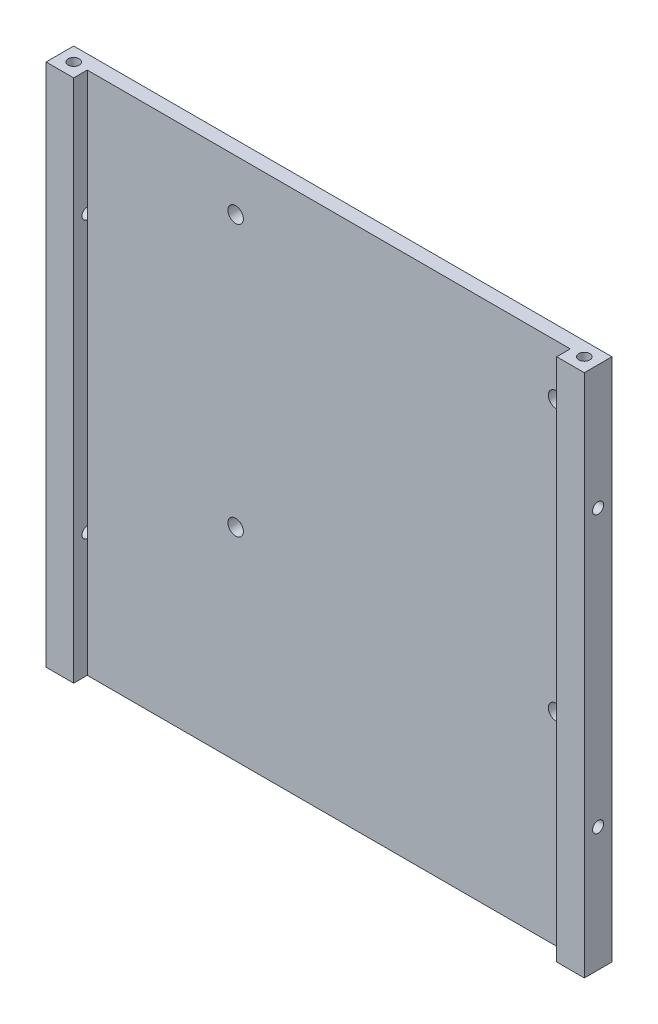
ISO-10303-21;
HEADER;
FILE_DESCRIPTION(('STEP AP214'),'2;1');
FILE_NAME('part.step','',(''),(''),'','','');
FILE_SCHEMA(('AUTOMOTIVE_DESIGN { 1 0 10303 214 1 1 1 1 }'));
ENDSEC;
DATA;
#1=APPLICATION_CONTEXT('core data for automotive mechanical design processes');
#2=APPLICATION_PROTOCOL_DEFINITION('international standard','automotive_design',2000,#1);
#3=PRODUCT_CONTEXT('',#1,'mechanical');
#4=PRODUCT('Part','Part','',(#3));
#5=PRODUCT_RELATED_PRODUCT_CATEGORY('part','',(#4));
#6=PRODUCT_DEFINITION_FORMATION('','',#4);
#7=PRODUCT_DEFINITION_CONTEXT('part definition',#1,'design');
#8=PRODUCT_DEFINITION('design','',#6,#7);
#9=PRODUCT_DEFINITION_SHAPE('','',#8);
#10=(LENGTH_UNIT() NAMED_UNIT(*) SI_UNIT(.MILLI.,.METRE.));
#11=(NAMED_UNIT(*) PLANE_ANGLE_UNIT() SI_UNIT($,.RADIAN.));
#12=(NAMED_UNIT(*) SI_UNIT($,.STERADIAN.) SOLID_ANGLE_UNIT());
#13=UNCERTAINTY_MEASURE_WITH_UNIT(LENGTH_MEASURE(1.E-05),#10,'distance_accuracy_value','');
#14=(GEOMETRIC_REPRESENTATION_CONTEXT(3) GLOBAL_UNCERTAINTY_ASSIGNED_CONTEXT((#13)) GLOBAL_UNIT_ASSIGNED_CONTEXT((#10,
#11,#12)) REPRESENTATION_CONTEXT('',''));
#15=CARTESIAN_POINT('',(0.,0.,0.));
#16=DIRECTION('',(0.,0.,1.));
#17=DIRECTION('',(1.,0.,0.));
#18=AXIS2_PLACEMENT_3D('',#15,#16,#17);
#19=CARTESIAN_POINT('',(92.4599999999999,0.,5.));
#20=DIRECTION('',(1.,0.,0.));
#21=DIRECTION('',(0.,0.,-1.));
#22=AXIS2_PLACEMENT_3D('',#19,#20,#21);
#23=PLANE('',#22);
#24=DIRECTION('',(0.,1.,0.));
#25=VECTOR('',#24,1.);
#26=CARTESIAN_POINT('',(92.4599999999999,96.19,2.54));
#27=LINE('',#26,#25);
#28=CARTESIAN_POINT('',(92.4599999999999,1.27,2.54));
#29=VERTEX_POINT('',#28);
#30=CARTESIAN_POINT('',(92.4599999999999,22.7308003202563,2.54));
#31=VERTEX_POINT('',#30);
#32=EDGE_CURVE('E309',#29,#31,#27,.T.);
#33=ORIENTED_EDGE('',*,*,#32,.F.);
#34=DIRECTION('',(0.,0.,-1.));
#35=VECTOR('',#34,1.);
#36=CARTESIAN_POINT('',(92.4599999999999,1.27,1.27));
#37=LINE('',#36,#35);
#38=CARTESIAN_POINT('',(92.4599999999999,1.27,5.));
#39=VERTEX_POINT('',#38);
#40=EDGE_CURVE('E168',#39,#29,#37,.T.);
#41=ORIENTED_EDGE('',*,*,#40,.F.);
#42=DIRECTION('',(0.,-1.,0.));
#43=VECTOR('',#42,1.);
#44=CARTESIAN_POINT('',(92.4599999999999,0.,5.));
#45=LINE('',#44,#43);
#46=CARTESIAN_POINT('',(92.4599999999999,96.19,5.));
#47=VERTEX_POINT('',#46);
#48=EDGE_CURVE('E230',#47,#39,#45,.T.);
#49=ORIENTED_EDGE('',*,*,#48,.F.);
#50=DIRECTION('',(0.,0.,1.));
#51=VECTOR('',#50,1.);
#52=CARTESIAN_POINT('',(92.4599999999999,96.19,1.27));
#53=LINE('',#52,#51);
#54=CARTESIAN_POINT('',(92.4599999999999,96.19,2.54));
#55=VERTEX_POINT('',#54);
#56=EDGE_CURVE('E317',#55,#47,#53,.T.);
#57=ORIENTED_EDGE('',*,*,#56,.F.);
#58=CARTESIAN_POINT('',(92.4599999999999,74.7291996797437,2.54));
#59=VERTEX_POINT('',#58);
#60=EDGE_CURVE('E137',#59,#55,#27,.T.);
#61=ORIENTED_EDGE('',*,*,#60,.F.);
#62=CARTESIAN_POINT('',(92.4599999999999,73.73,2.5));
#63=DIRECTION('',(1.,0.,0.));
#64=DIRECTION('',(0.,0.,-1.));
#65=AXIS2_PLACEMENT_3D('',#62,#63,#64);
#66=CIRCLE('',#65,0.999999999999999);
#67=CARTESIAN_POINT('',(92.4599999999999,72.7308003202563,2.54));
#68=VERTEX_POINT('',#67);
#69=EDGE_CURVE('E191',#68,#59,#66,.F.);
#70=ORIENTED_EDGE('',*,*,#69,.F.);
#71=CARTESIAN_POINT('',(92.4599999999999,24.7291996797437,2.54));
#72=VERTEX_POINT('',#71);
#73=EDGE_CURVE('E685',#72,#68,#27,.T.);
#74=ORIENTED_EDGE('',*,*,#73,.F.);
#75=CARTESIAN_POINT('',(92.4599999999999,23.73,2.49999999999999));
#76=DIRECTION('',(1.,0.,0.));
#77=DIRECTION('',(0.,0.,-1.));
#78=AXIS2_PLACEMENT_3D('',#75,#76,#77);
#79=CIRCLE('',#78,0.999999999999999);
#80=EDGE_CURVE('E192',#31,#72,#79,.F.);
#81=ORIENTED_EDGE('',*,*,#80,.F.);
#82=EDGE_LOOP('',(#33,#41,#49,#57,#61,#70,#74,#81));
#83=FACE_BOUND('',#82,.T.);
#84=ADVANCED_FACE('F36',(#83),#23,.F.);
#85=CARTESIAN_POINT('',(5.,0.,5.));
#86=DIRECTION('',(-1.,0.,0.));
#87=DIRECTION('',(0.,0.,1.));
#88=AXIS2_PLACEMENT_3D('',#85,#86,#87);
#89=PLANE('',#88);
#90=DIRECTION('',(0.,-1.,0.));
#91=VECTOR('',#90,1.);
#92=CARTESIAN_POINT('',(5.,1.27,2.54));
#93=LINE('',#92,#91);
#94=CARTESIAN_POINT('',(5.,96.19,2.54));
#95=VERTEX_POINT('',#94);
#96=CARTESIAN_POINT('',(5.,74.7291996797437,2.54));
#97=VERTEX_POINT('',#96);
#98=EDGE_CURVE('E133',#95,#97,#93,.T.);
#99=ORIENTED_EDGE('',*,*,#98,.F.);
#100=DIRECTION('',(0.,0.,-1.));
#101=VECTOR('',#100,1.);
#102=CARTESIAN_POINT('',(5.,96.19,5.));
#103=LINE('',#102,#101);
#104=CARTESIAN_POINT('',(5.,96.19,5.));
#105=VERTEX_POINT('',#104);
#106=EDGE_CURVE('E146',#105,#95,#103,.T.);
#107=ORIENTED_EDGE('',*,*,#106,.F.);
#108=DIRECTION('',(0.,1.,0.));
#109=VECTOR('',#108,1.);
#110=CARTESIAN_POINT('',(5.,0.,5.));
#111=LINE('',#110,#109);
#112=CARTESIAN_POINT('',(5.,1.27,5.));
#113=VERTEX_POINT('',#112);
#114=EDGE_CURVE('E223',#113,#105,#111,.T.);
#115=ORIENTED_EDGE('',*,*,#114,.F.);
#116=DIRECTION('',(0.,0.,1.));
#117=VECTOR('',#116,1.);
#118=CARTESIAN_POINT('',(5.,1.27,5.));
#119=LINE('',#118,#117);
#120=CARTESIAN_POINT('',(5.,1.27,2.54));
#121=VERTEX_POINT('',#120);
#122=EDGE_CURVE('E61',#121,#113,#119,.T.);
#123=ORIENTED_EDGE('',*,*,#122,.F.);
#124=CARTESIAN_POINT('',(5.,22.7308003202563,2.54));
#125=VERTEX_POINT('',#124);
#126=EDGE_CURVE('E140',#125,#121,#93,.T.);
#127=ORIENTED_EDGE('',*,*,#126,.F.);
#128=CARTESIAN_POINT('',(5.,23.73,2.49999999999983));
#129=DIRECTION('',(-1.,0.,0.));
#130=DIRECTION('',(0.,0.,1.));
#131=AXIS2_PLACEMENT_3D('',#128,#129,#130);
#132=CIRCLE('',#131,0.999999999999999);
#133=CARTESIAN_POINT('',(5.,24.7291996797438,2.54));
#134=VERTEX_POINT('',#133);
#135=EDGE_CURVE('E203',#134,#125,#132,.F.);
#136=ORIENTED_EDGE('',*,*,#135,.F.);
#137=CARTESIAN_POINT('',(5.,72.7308003202563,2.54));
#138=VERTEX_POINT('',#137);
#139=EDGE_CURVE('E301',#138,#134,#93,.T.);
#140=ORIENTED_EDGE('',*,*,#139,.F.);
#141=CARTESIAN_POINT('',(5.,73.73,2.49999999999948));
#142=DIRECTION('',(-1.,0.,0.));
#143=DIRECTION('',(0.,0.,1.));
#144=AXIS2_PLACEMENT_3D('',#141,#142,#143);
#145=CIRCLE('',#144,1.);
#146=EDGE_CURVE('E150',#97,#138,#145,.F.);
#147=ORIENTED_EDGE('',*,*,#146,.F.);
#148=EDGE_LOOP('',(#99,#107,#115,#123,#127,#136,#140,#147));
#149=FACE_BOUND('',#148,.T.);
#150=ADVANCED_FACE('F144',(#149),#89,.F.);
#151=CARTESIAN_POINT('',(97.4599999999999,0.,1.27));
#152=DIRECTION('',(-1.,0.,0.));
#153=DIRECTION('',(0.,0.,1.));
#154=AXIS2_PLACEMENT_3D('',#151,#152,#153);
#155=PLANE('',#154);
#156=CARTESIAN_POINT('',(97.4599999999999,73.73,2.5));
#157=DIRECTION('',(1.,0.,0.));
#158=DIRECTION('',(0.,0.,1.));
#159=AXIS2_PLACEMENT_3D('',#156,#157,#158);
#160=CIRCLE('',#159,0.999999999999999);
#161=CARTESIAN_POINT('',(97.4599999999999,73.73,3.5));
#162=VERTEX_POINT('',#161);
#163=EDGE_CURVE('E188',#162,#162,#160,.T.);
#164=ORIENTED_EDGE('',*,*,#163,.F.);
#165=EDGE_LOOP('',(#164));
#166=FACE_BOUND('',#165,.T.);
#167=CARTESIAN_POINT('',(97.4599999999999,23.73,2.49999999999999));
#168=DIRECTION('',(1.,0.,0.));
#169=DIRECTION('',(0.,0.,1.));
#170=AXIS2_PLACEMENT_3D('',#167,#168,#169);
#171=CIRCLE('',#170,0.999999999999999);
#172=CARTESIAN_POINT('',(97.4599999999999,23.73,3.49999999999999));
#173=VERTEX_POINT('',#172);
#174=EDGE_CURVE('E187',#173,#173,#171,.T.);
#175=ORIENTED_EDGE('',*,*,#174,.F.);
#176=EDGE_LOOP('',(#175));
#177=FACE_BOUND('',#176,.T.);
#178=DIRECTION('',(0.,1.,0.));
#179=VECTOR('',#178,1.);
#180=CARTESIAN_POINT('',(97.4599999999999,0.,0.));
#181=LINE('',#180,#179);
#182=CARTESIAN_POINT('',(97.4599999999999,1.27,0.));
#183=VERTEX_POINT('',#182);
#184=CARTESIAN_POINT('',(97.4599999999999,96.19,0.));
#185=VERTEX_POINT('',#184);
#186=EDGE_CURVE('E45',#183,#185,#181,.T.);
#187=ORIENTED_EDGE('',*,*,#186,.T.);
#188=DIRECTION('',(0.,0.,-1.));
#189=VECTOR('',#188,1.);
#190=CARTESIAN_POINT('',(97.4599999999999,96.19,5.));
#191=LINE('',#190,#189);
#192=CARTESIAN_POINT('',(97.4599999999999,96.19,5.));
#193=VERTEX_POINT('',#192);
#194=EDGE_CURVE('E321',#193,#185,#191,.T.);
#195=ORIENTED_EDGE('',*,*,#194,.F.);
#196=DIRECTION('',(0.,1.,0.));
#197=VECTOR('',#196,1.);
#198=CARTESIAN_POINT('',(97.4599999999999,0.,5.));
#199=LINE('',#198,#197);
#200=CARTESIAN_POINT('',(97.4599999999999,1.27,5.));
#201=VERTEX_POINT('',#200);
#202=EDGE_CURVE('E227',#201,#193,#199,.T.);
#203=ORIENTED_EDGE('',*,*,#202,.F.);
#204=DIRECTION('',(0.,0.,1.));
#205=VECTOR('',#204,1.);
#206=CARTESIAN_POINT('',(97.4599999999999,1.27,5.));
#207=LINE('',#206,#205);
#208=EDGE_CURVE('E178',#183,#201,#207,.T.);
#209=ORIENTED_EDGE('',*,*,#208,.F.);
#210=EDGE_LOOP('',(#187,#195,#203,#209));
#211=FACE_BOUND('',#210,.T.);
#212=ADVANCED_FACE('F38',(#166,#177,#211),#155,.F.);
#213=CARTESIAN_POINT('',(0.,0.,1.27));
#214=DIRECTION('',(-1.,0.,0.));
#215=DIRECTION('',(0.,0.,1.));
#216=AXIS2_PLACEMENT_3D('',#213,#214,#215);
#217=PLANE('',#216);
#218=DIRECTION('',(0.,0.,1.));
#219=VECTOR('',#218,1.);
#220=CARTESIAN_POINT('',(0.,96.19,0.));
#221=LINE('',#220,#219);
#222=CARTESIAN_POINT('',(0.,96.19,0.));
#223=VERTEX_POINT('',#222);
#224=CARTESIAN_POINT('',(0.,96.19,5.));
#225=VERTEX_POINT('',#224);
#226=EDGE_CURVE('E53',#223,#225,#221,.T.);
#227=ORIENTED_EDGE('',*,*,#226,.F.);
#228=DIRECTION('',(0.,1.,0.));
#229=VECTOR('',#228,1.);
#230=CARTESIAN_POINT('',(0.,0.,0.));
#231=LINE('',#230,#229);
#232=CARTESIAN_POINT('',(0.,1.27,0.));
#233=VERTEX_POINT('',#232);
#234=EDGE_CURVE('E11',#233,#223,#231,.T.);
#235=ORIENTED_EDGE('',*,*,#234,.F.);
#236=DIRECTION('',(0.,0.,-1.));
#237=VECTOR('',#236,1.);
#238=CARTESIAN_POINT('',(0.,1.27,0.));
#239=LINE('',#238,#237);
#240=CARTESIAN_POINT('',(0.,1.27,5.));
#241=VERTEX_POINT('',#240);
#242=EDGE_CURVE('E174',#241,#233,#239,.T.);
#243=ORIENTED_EDGE('',*,*,#242,.F.);
#244=DIRECTION('',(0.,-1.,0.));
#245=VECTOR('',#244,1.);
#246=CARTESIAN_POINT('',(0.,0.,5.));
#247=LINE('',#246,#245);
#248=EDGE_CURVE('E225',#225,#241,#247,.T.);
#249=ORIENTED_EDGE('',*,*,#248,.F.);
#250=EDGE_LOOP('',(#227,#235,#243,#249));
#251=FACE_BOUND('',#250,.T.);
#252=CARTESIAN_POINT('',(0.,23.73,2.49999999999983));
#253=DIRECTION('',(-1.,0.,0.));
#254=DIRECTION('',(0.,0.,-1.));
#255=AXIS2_PLACEMENT_3D('',#252,#253,#254);
#256=CIRCLE('',#255,0.999999999999999);
#257=CARTESIAN_POINT('',(0.,23.73,1.49999999999983));
#258=VERTEX_POINT('',#257);
#259=EDGE_CURVE('E202',#258,#258,#256,.T.);
#260=ORIENTED_EDGE('',*,*,#259,.F.);
#261=EDGE_LOOP('',(#260));
#262=FACE_BOUND('',#261,.T.);
#263=CARTESIAN_POINT('',(0.,73.73,2.49999999999948));
#264=DIRECTION('',(-1.,0.,0.));
#265=DIRECTION('',(0.,0.,-1.));
#266=AXIS2_PLACEMENT_3D('',#263,#264,#265);
#267=CIRCLE('',#266,1.);
#268=CARTESIAN_POINT('',(0.,73.73,1.49999999999948));
#269=VERTEX_POINT('',#268);
#270=EDGE_CURVE('E209',#269,#269,#267,.T.);
#271=ORIENTED_EDGE('',*,*,#270,.F.);
#272=EDGE_LOOP('',(#271));
#273=FACE_BOUND('',#272,.T.);
#274=ADVANCED_FACE('F276',(#251,#262,#273),#217,.T.);
#275=CARTESIAN_POINT('',(0.,0.,0.));
#276=DIRECTION('',(0.,0.,1.));
#277=DIRECTION('',(1.,0.,0.));
#278=AXIS2_PLACEMENT_3D('',#275,#276,#277);
#279=PLANE('',#278);
#280=CARTESIAN_POINT('',(89.8740616525176,37.943406611491,0.));
#281=DIRECTION('',(0.,0.,-1.));
#282=DIRECTION('',(-1.,0.,0.));
#283=AXIS2_PLACEMENT_3D('',#280,#281,#282);
#284=CIRCLE('',#283,1.40000000000001);
#285=CARTESIAN_POINT('',(88.4740616525176,37.943406611491,0.));
#286=VERTEX_POINT('',#285);
#287=EDGE_CURVE('E423',#286,#286,#284,.T.);
#288=ORIENTED_EDGE('',*,*,#287,.F.);
#289=EDGE_LOOP('',(#288));
#290=FACE_BOUND('',#289,.T.);
#291=CARTESIAN_POINT('',(31.8640616525178,86.9534066114912,0.));
#292=DIRECTION('',(0.,0.,-1.));
#293=DIRECTION('',(-1.,0.,0.));
#294=AXIS2_PLACEMENT_3D('',#291,#292,#293);
#295=CIRCLE('',#294,1.39999999999999);
#296=CARTESIAN_POINT('',(30.4640616525178,86.9534066114912,0.));
#297=VERTEX_POINT('',#296);
#298=EDGE_CURVE('E420',#297,#297,#295,.T.);
#299=ORIENTED_EDGE('',*,*,#298,.F.);
#300=EDGE_LOOP('',(#299));
#301=FACE_BOUND('',#300,.T.);
#302=CARTESIAN_POINT('',(89.8740616525178,86.953406611491,0.));
#303=DIRECTION('',(0.,0.,-1.));
#304=DIRECTION('',(-1.,0.,0.));
#305=AXIS2_PLACEMENT_3D('',#302,#303,#304);
#306=CIRCLE('',#305,1.40000000000001);
#307=CARTESIAN_POINT('',(88.4740616525178,86.953406611491,0.));
#308=VERTEX_POINT('',#307);
#309=EDGE_CURVE('E418',#308,#308,#306,.T.);
#310=ORIENTED_EDGE('',*,*,#309,.F.);
#311=EDGE_LOOP('',(#310));
#312=FACE_BOUND('',#311,.T.);
#313=CARTESIAN_POINT('',(31.8640616525176,37.9434066114912,0.));
#314=DIRECTION('',(0.,0.,-1.));
#315=DIRECTION('',(-1.,0.,0.));
#316=AXIS2_PLACEMENT_3D('',#313,#314,#315);
#317=CIRCLE('',#316,1.4);
#318=CARTESIAN_POINT('',(30.4640616525176,37.9434066114912,0.));
#319=VERTEX_POINT('',#318);
#320=EDGE_CURVE('E240',#319,#319,#317,.T.);
#321=ORIENTED_EDGE('',*,*,#320,.F.);
#322=EDGE_LOOP('',(#321));
#323=FACE_BOUND('',#322,.T.);
#324=ORIENTED_EDGE('',*,*,#234,.T.);
#325=DIRECTION('',(-1.,0.,0.));
#326=VECTOR('',#325,1.);
#327=CARTESIAN_POINT('',(97.4599999999999,96.19,0.));
#328=LINE('',#327,#326);
#329=EDGE_CURVE('E323',#185,#223,#328,.T.);
#330=ORIENTED_EDGE('',*,*,#329,.F.);
#331=ORIENTED_EDGE('',*,*,#186,.F.);
#332=DIRECTION('',(1.,0.,0.));
#333=VECTOR('',#332,1.);
#334=CARTESIAN_POINT('',(97.4599999999999,1.27,0.));
#335=LINE('',#334,#333);
#336=EDGE_CURVE('E176',#233,#183,#335,.T.);
#337=ORIENTED_EDGE('',*,*,#336,.F.);
#338=EDGE_LOOP('',(#324,#330,#331,#337));
#339=FACE_BOUND('',#338,.T.);
#340=ADVANCED_FACE('F274',(#290,#301,#312,#323,#339),#279,.F.);
#341=CARTESIAN_POINT('',(0.,0.,5.));
#342=DIRECTION('',(0.,0.,1.));
#343=DIRECTION('',(1.,0.,0.));
#344=AXIS2_PLACEMENT_3D('',#341,#342,#343);
#345=PLANE('',#344);
#346=DIRECTION('',(1.,0.,0.));
#347=VECTOR('',#346,1.);
#348=CARTESIAN_POINT('',(92.4599999999999,96.19,5.));
#349=LINE('',#348,#347);
#350=EDGE_CURVE('E319',#47,#193,#349,.T.);
#351=ORIENTED_EDGE('',*,*,#350,.F.);
#352=ORIENTED_EDGE('',*,*,#48,.T.);
#353=DIRECTION('',(-1.,0.,0.));
#354=VECTOR('',#353,1.);
#355=CARTESIAN_POINT('',(92.4599999999999,1.27,5.));
#356=LINE('',#355,#354);
#357=EDGE_CURVE('E180',#201,#39,#356,.T.);
#358=ORIENTED_EDGE('',*,*,#357,.F.);
#359=ORIENTED_EDGE('',*,*,#202,.T.);
#360=EDGE_LOOP('',(#351,#352,#358,#359));
#361=FACE_BOUND('',#360,.T.);
#362=ADVANCED_FACE('F273',(#361),#345,.T.);
#363=CARTESIAN_POINT('',(0.,0.,5.));
#364=DIRECTION('',(0.,0.,1.));
#365=DIRECTION('',(1.,0.,0.));
#366=AXIS2_PLACEMENT_3D('',#363,#364,#365);
#367=PLANE('',#366);
#368=DIRECTION('',(1.,0.,0.));
#369=VECTOR('',#368,1.);
#370=CARTESIAN_POINT('',(0.,96.19,5.));
#371=LINE('',#370,#369);
#372=EDGE_CURVE('E157',#225,#105,#371,.T.);
#373=ORIENTED_EDGE('',*,*,#372,.F.);
#374=ORIENTED_EDGE('',*,*,#248,.T.);
#375=DIRECTION('',(-1.,0.,0.));
#376=VECTOR('',#375,1.);
#377=CARTESIAN_POINT('',(0.,1.27,5.));
#378=LINE('',#377,#376);
#379=EDGE_CURVE('E172',#113,#241,#378,.T.);
#380=ORIENTED_EDGE('',*,*,#379,.F.);
#381=ORIENTED_EDGE('',*,*,#114,.T.);
#382=EDGE_LOOP('',(#373,#374,#380,#381));
#383=FACE_BOUND('',#382,.T.);
#384=ADVANCED_FACE('F295',(#383),#367,.T.);
#385=CARTESIAN_POINT('',(97.4609999999999,73.73,2.49999999999948));
#386=DIRECTION('',(-1.,0.,0.));
#387=DIRECTION('',(0.,0.,1.));
#388=AXIS2_PLACEMENT_3D('',#385,#386,#387);
#389=CYLINDRICAL_SURFACE('',#388,1.);
#390=ORIENTED_EDGE('',*,*,#270,.T.);
#391=EDGE_LOOP('',(#390));
#392=FACE_BOUND('',#391,.T.);
#393=EDGE_CURVE('E207',#138,#97,#145,.F.);
#394=ORIENTED_EDGE('',*,*,#393,.T.);
#395=ORIENTED_EDGE('',*,*,#146,.T.);
#396=EDGE_LOOP('',(#394,#395));
#397=FACE_BOUND('',#396,.T.);
#398=ADVANCED_FACE('F291',(#392,#397),#389,.F.);
#399=CARTESIAN_POINT('',(97.4609999999999,23.73,2.49999999999983));
#400=DIRECTION('',(-1.,0.,0.));
#401=DIRECTION('',(0.,0.,1.));
#402=AXIS2_PLACEMENT_3D('',#399,#400,#401);
#403=CYLINDRICAL_SURFACE('',#402,0.999999999999999);
#404=ORIENTED_EDGE('',*,*,#259,.T.);
#405=EDGE_LOOP('',(#404));
#406=FACE_BOUND('',#405,.T.);
#407=EDGE_CURVE('E199',#125,#134,#132,.F.);
#408=ORIENTED_EDGE('',*,*,#407,.T.);
#409=ORIENTED_EDGE('',*,*,#135,.T.);
#410=EDGE_LOOP('',(#408,#409));
#411=FACE_BOUND('',#410,.T.);
#412=ADVANCED_FACE('F294',(#406,#411),#403,.F.);
#413=CARTESIAN_POINT('',(-0.001000000000001,23.73,2.49999999999999));
#414=DIRECTION('',(1.,0.,0.));
#415=DIRECTION('',(0.,0.,-1.));
#416=AXIS2_PLACEMENT_3D('',#413,#414,#415);
#417=CYLINDRICAL_SURFACE('',#416,0.999999999999999);
#418=ORIENTED_EDGE('',*,*,#174,.T.);
#419=EDGE_LOOP('',(#418));
#420=FACE_BOUND('',#419,.T.);
#421=ORIENTED_EDGE('',*,*,#80,.T.);
#422=CARTESIAN_POINT('',(92.4599999999999,23.73,2.49999999999999));
#423=DIRECTION('',(-1.,0.,0.));
#424=DIRECTION('',(0.,0.,1.));
#425=AXIS2_PLACEMENT_3D('',#422,#423,#424);
#426=CIRCLE('',#425,0.999999999999999);
#427=EDGE_CURVE('E315',#31,#72,#426,.F.);
#428=ORIENTED_EDGE('',*,*,#427,.F.);
#429=EDGE_LOOP('',(#421,#428));
#430=FACE_BOUND('',#429,.T.);
#431=ADVANCED_FACE('F382',(#420,#430),#417,.F.);
#432=CARTESIAN_POINT('',(-0.001000000000001,73.73,2.5));
#433=DIRECTION('',(1.,0.,0.));
#434=DIRECTION('',(0.,0.,-1.));
#435=AXIS2_PLACEMENT_3D('',#432,#433,#434);
#436=CYLINDRICAL_SURFACE('',#435,0.999999999999999);
#437=ORIENTED_EDGE('',*,*,#163,.T.);
#438=EDGE_LOOP('',(#437));
#439=FACE_BOUND('',#438,.T.);
#440=ORIENTED_EDGE('',*,*,#69,.T.);
#441=CARTESIAN_POINT('',(92.4599999999999,73.73,2.5));
#442=DIRECTION('',(-1.,0.,0.));
#443=DIRECTION('',(0.,0.,1.));
#444=AXIS2_PLACEMENT_3D('',#441,#442,#443);
#445=CIRCLE('',#444,0.999999999999999);
#446=EDGE_CURVE('E312',#68,#59,#445,.F.);
#447=ORIENTED_EDGE('',*,*,#446,.F.);
#448=EDGE_LOOP('',(#440,#447));
#449=FACE_BOUND('',#448,.T.);
#450=ADVANCED_FACE('F386',(#439,#449),#436,.F.);
#451=CARTESIAN_POINT('',(0.,1.27,0.));
#452=DIRECTION('',(0.,1.,0.));
#453=DIRECTION('',(0.,0.,1.));
#454=AXIS2_PLACEMENT_3D('',#451,#452,#453);
#455=PLANE('',#454);
#456=DIRECTION('',(1.,0.,0.));
#457=VECTOR('',#456,1.);
#458=CARTESIAN_POINT('',(92.4599999999999,1.27,2.54));
#459=LINE('',#458,#457);
#460=EDGE_CURVE('E152',#121,#29,#459,.T.);
#461=ORIENTED_EDGE('',*,*,#460,.F.);
#462=ORIENTED_EDGE('',*,*,#122,.T.);
#463=ORIENTED_EDGE('',*,*,#379,.T.);
#464=ORIENTED_EDGE('',*,*,#242,.T.);
#465=ORIENTED_EDGE('',*,*,#336,.T.);
#466=ORIENTED_EDGE('',*,*,#208,.T.);
#467=ORIENTED_EDGE('',*,*,#357,.T.);
#468=ORIENTED_EDGE('',*,*,#40,.T.);
#469=EDGE_LOOP('',(#461,#462,#463,#464,#465,#466,#467,#468));
#470=FACE_BOUND('',#469,.T.);
#471=CARTESIAN_POINT('',(2.5,1.27,2.5));
#472=DIRECTION('',(0.,1.,0.));
#473=DIRECTION('',(0.,0.,1.));
#474=AXIS2_PLACEMENT_3D('',#471,#472,#473);
#475=CIRCLE('',#474,0.999999999999997);
#476=CARTESIAN_POINT('',(2.5,1.27,3.5));
#477=VERTEX_POINT('',#476);
#478=EDGE_CURVE('E183',#477,#477,#475,.F.);
#479=ORIENTED_EDGE('',*,*,#478,.F.);
#480=EDGE_LOOP('',(#479));
#481=FACE_BOUND('',#480,.T.);
#482=CARTESIAN_POINT('',(94.9599999999999,1.27,2.5));
#483=DIRECTION('',(0.,1.,0.));
#484=DIRECTION('',(0.,0.,1.));
#485=AXIS2_PLACEMENT_3D('',#482,#483,#484);
#486=CIRCLE('',#485,0.999999999999998);
#487=CARTESIAN_POINT('',(94.9599999999999,1.27,3.5));
#488=VERTEX_POINT('',#487);
#489=EDGE_CURVE('E184',#488,#488,#486,.F.);
#490=ORIENTED_EDGE('',*,*,#489,.F.);
#491=EDGE_LOOP('',(#490));
#492=FACE_BOUND('',#491,.T.);
#493=ADVANCED_FACE('F333',(#470,#481,#492),#455,.F.);
#494=CARTESIAN_POINT('',(94.9599999999999,5.,2.5));
#495=DIRECTION('',(0.,-1.,0.));
#496=DIRECTION('',(0.,0.,-1.));
#497=AXIS2_PLACEMENT_3D('',#494,#495,#496);
#498=PLANE('',#497);
#499=CARTESIAN_POINT('',(94.9599999999999,5.,2.5));
#500=DIRECTION('',(0.,-1.,0.));
#501=DIRECTION('',(0.,0.,-1.));
#502=AXIS2_PLACEMENT_3D('',#499,#500,#501);
#503=CIRCLE('',#502,0.999999999999998);
#504=CARTESIAN_POINT('',(94.9599999999999,5.,1.5));
#505=VERTEX_POINT('',#504);
#506=EDGE_CURVE('E214',#505,#505,#503,.T.);
#507=ORIENTED_EDGE('',*,*,#506,.T.);
#508=EDGE_LOOP('',(#507));
#509=FACE_BOUND('',#508,.T.);
#510=ADVANCED_FACE('F368',(#509),#498,.T.);
#511=CARTESIAN_POINT('',(94.9599999999999,5.,2.5));
#512=DIRECTION('',(0.,-1.,0.));
#513=DIRECTION('',(0.,0.,-1.));
#514=AXIS2_PLACEMENT_3D('',#511,#512,#513);
#515=CYLINDRICAL_SURFACE('',#514,0.999999999999998);
#516=ORIENTED_EDGE('',*,*,#489,.T.);
#517=EDGE_LOOP('',(#516));
#518=FACE_BOUND('',#517,.T.);
#519=ORIENTED_EDGE('',*,*,#506,.F.);
#520=EDGE_LOOP('',(#519));
#521=FACE_BOUND('',#520,.T.);
#522=ADVANCED_FACE('F364',(#518,#521),#515,.F.);
#523=CARTESIAN_POINT('',(2.5,5.,2.5));
#524=DIRECTION('',(0.,-1.,0.));
#525=DIRECTION('',(0.,0.,-1.));
#526=AXIS2_PLACEMENT_3D('',#523,#524,#525);
#527=PLANE('',#526);
#528=CARTESIAN_POINT('',(2.5,5.,2.5));
#529=DIRECTION('',(0.,-1.,0.));
#530=DIRECTION('',(0.,0.,-1.));
#531=AXIS2_PLACEMENT_3D('',#528,#529,#530);
#532=CIRCLE('',#531,0.999999999999997);
#533=CARTESIAN_POINT('',(2.5,5.,1.5));
#534=VERTEX_POINT('',#533);
#535=EDGE_CURVE('E206',#534,#534,#532,.T.);
#536=ORIENTED_EDGE('',*,*,#535,.T.);
#537=EDGE_LOOP('',(#536));
#538=FACE_BOUND('',#537,.T.);
#539=ADVANCED_FACE('F367',(#538),#527,.T.);
#540=CARTESIAN_POINT('',(2.5,5.,2.5));
#541=DIRECTION('',(0.,-1.,0.));
#542=DIRECTION('',(0.,0.,-1.));
#543=AXIS2_PLACEMENT_3D('',#540,#541,#542);
#544=CYLINDRICAL_SURFACE('',#543,0.999999999999997);
#545=ORIENTED_EDGE('',*,*,#478,.T.);
#546=EDGE_LOOP('',(#545));
#547=FACE_BOUND('',#546,.T.);
#548=ORIENTED_EDGE('',*,*,#535,.F.);
#549=EDGE_LOOP('',(#548));
#550=FACE_BOUND('',#549,.T.);
#551=ADVANCED_FACE('F373',(#547,#550),#544,.F.);
#552=CARTESIAN_POINT('',(0.,96.19,0.));
#553=DIRECTION('',(0.,-1.,0.));
#554=DIRECTION('',(0.,0.,-1.));
#555=AXIS2_PLACEMENT_3D('',#552,#553,#554);
#556=PLANE('',#555);
#557=DIRECTION('',(-1.,0.,0.));
#558=VECTOR('',#557,1.);
#559=CARTESIAN_POINT('',(5.,96.19,2.54));
#560=LINE('',#559,#558);
#561=EDGE_CURVE('E129',#55,#95,#560,.T.);
#562=ORIENTED_EDGE('',*,*,#561,.F.);
#563=ORIENTED_EDGE('',*,*,#56,.T.);
#564=ORIENTED_EDGE('',*,*,#350,.T.);
#565=ORIENTED_EDGE('',*,*,#194,.T.);
#566=ORIENTED_EDGE('',*,*,#329,.T.);
#567=ORIENTED_EDGE('',*,*,#226,.T.);
#568=ORIENTED_EDGE('',*,*,#372,.T.);
#569=ORIENTED_EDGE('',*,*,#106,.T.);
#570=EDGE_LOOP('',(#562,#563,#564,#565,#566,#567,#568,#569));
#571=FACE_BOUND('',#570,.T.);
#572=CARTESIAN_POINT('',(94.9599999999999,96.19,2.5));
#573=DIRECTION('',(0.,-1.,0.));
#574=DIRECTION('',(0.,0.,-1.));
#575=AXIS2_PLACEMENT_3D('',#572,#573,#574);
#576=CIRCLE('',#575,0.999999999999998);
#577=CARTESIAN_POINT('',(94.9599999999999,96.19,1.5));
#578=VERTEX_POINT('',#577);
#579=EDGE_CURVE('E158',#578,#578,#576,.F.);
#580=ORIENTED_EDGE('',*,*,#579,.F.);
#581=EDGE_LOOP('',(#580));
#582=FACE_BOUND('',#581,.T.);
#583=CARTESIAN_POINT('',(2.5,96.19,2.5));
#584=DIRECTION('',(0.,-1.,0.));
#585=DIRECTION('',(0.,0.,-1.));
#586=AXIS2_PLACEMENT_3D('',#583,#584,#585);
#587=CIRCLE('',#586,0.999999999999998);
#588=CARTESIAN_POINT('',(2.5,96.19,1.5));
#589=VERTEX_POINT('',#588);
#590=EDGE_CURVE('E161',#589,#589,#587,.F.);
#591=ORIENTED_EDGE('',*,*,#590,.F.);
#592=EDGE_LOOP('',(#591));
#593=FACE_BOUND('',#592,.T.);
#594=ADVANCED_FACE('F155',(#571,#582,#593),#556,.F.);
#595=CARTESIAN_POINT('',(2.5,92.46,2.5));
#596=DIRECTION('',(0.,1.,0.));
#597=DIRECTION('',(0.,0.,1.));
#598=AXIS2_PLACEMENT_3D('',#595,#596,#597);
#599=PLANE('',#598);
#600=CARTESIAN_POINT('',(2.5,92.46,2.5));
#601=DIRECTION('',(0.,1.,0.));
#602=DIRECTION('',(0.,0.,1.));
#603=AXIS2_PLACEMENT_3D('',#600,#601,#602);
#604=CIRCLE('',#603,0.999999999999998);
#605=CARTESIAN_POINT('',(2.5,92.46,3.5));
#606=VERTEX_POINT('',#605);
#607=EDGE_CURVE('E220',#606,#606,#604,.T.);
#608=ORIENTED_EDGE('',*,*,#607,.T.);
#609=EDGE_LOOP('',(#608));
#610=FACE_BOUND('',#609,.T.);
#611=ADVANCED_FACE('F352',(#610),#599,.T.);
#612=CARTESIAN_POINT('',(2.5,92.46,2.5));
#613=DIRECTION('',(0.,1.,0.));
#614=DIRECTION('',(0.,0.,1.));
#615=AXIS2_PLACEMENT_3D('',#612,#613,#614);
#616=CYLINDRICAL_SURFACE('',#615,0.999999999999998);
#617=ORIENTED_EDGE('',*,*,#590,.T.);
#618=EDGE_LOOP('',(#617));
#619=FACE_BOUND('',#618,.T.);
#620=ORIENTED_EDGE('',*,*,#607,.F.);
#621=EDGE_LOOP('',(#620));
#622=FACE_BOUND('',#621,.T.);
#623=ADVANCED_FACE('F348',(#619,#622),#616,.F.);
#624=CARTESIAN_POINT('',(94.9599999999999,92.46,2.5));
#625=DIRECTION('',(0.,1.,0.));
#626=DIRECTION('',(0.,0.,1.));
#627=AXIS2_PLACEMENT_3D('',#624,#625,#626);
#628=PLANE('',#627);
#629=CARTESIAN_POINT('',(94.9599999999999,92.46,2.5));
#630=DIRECTION('',(0.,1.,0.));
#631=DIRECTION('',(0.,0.,1.));
#632=AXIS2_PLACEMENT_3D('',#629,#630,#631);
#633=CIRCLE('',#632,0.999999999999998);
#634=CARTESIAN_POINT('',(94.9599999999999,92.46,3.5));
#635=VERTEX_POINT('',#634);
#636=EDGE_CURVE('E217',#635,#635,#633,.T.);
#637=ORIENTED_EDGE('',*,*,#636,.T.);
#638=EDGE_LOOP('',(#637));
#639=FACE_BOUND('',#638,.T.);
#640=ADVANCED_FACE('F351',(#639),#628,.T.);
#641=CARTESIAN_POINT('',(94.9599999999999,92.46,2.5));
#642=DIRECTION('',(0.,1.,0.));
#643=DIRECTION('',(0.,0.,1.));
#644=AXIS2_PLACEMENT_3D('',#641,#642,#643);
#645=CYLINDRICAL_SURFACE('',#644,0.999999999999998);
#646=ORIENTED_EDGE('',*,*,#579,.T.);
#647=EDGE_LOOP('',(#646));
#648=FACE_BOUND('',#647,.T.);
#649=ORIENTED_EDGE('',*,*,#636,.F.);
#650=EDGE_LOOP('',(#649));
#651=FACE_BOUND('',#650,.T.);
#652=ADVANCED_FACE('F357',(#648,#651),#645,.F.);
#653=CARTESIAN_POINT('',(5.,1.27,2.54));
#654=DIRECTION('',(1.,0.,0.));
#655=DIRECTION('',(0.,0.,-1.));
#656=AXIS2_PLACEMENT_3D('',#653,#654,#655);
#657=PLANE('',#656);
#658=EDGE_CURVE('E153',#97,#138,#93,.T.);
#659=ORIENTED_EDGE('',*,*,#658,.F.);
#660=ORIENTED_EDGE('',*,*,#393,.F.);
#661=EDGE_LOOP('',(#659,#660));
#662=FACE_BOUND('',#661,.T.);
#663=ADVANCED_FACE('F298',(#662),#657,.F.);
#664=EDGE_CURVE('E305',#134,#125,#93,.T.);
#665=ORIENTED_EDGE('',*,*,#664,.F.);
#666=ORIENTED_EDGE('',*,*,#407,.F.);
#667=EDGE_LOOP('',(#665,#666));
#668=FACE_BOUND('',#667,.T.);
#669=ADVANCED_FACE('F397',(#668),#657,.F.);
#670=CARTESIAN_POINT('',(92.4599999999999,96.19,2.54));
#671=DIRECTION('',(-1.,0.,0.));
#672=DIRECTION('',(0.,0.,1.));
#673=AXIS2_PLACEMENT_3D('',#670,#671,#672);
#674=PLANE('',#673);
#675=EDGE_CURVE('E313',#31,#72,#27,.T.);
#676=ORIENTED_EDGE('',*,*,#675,.F.);
#677=ORIENTED_EDGE('',*,*,#427,.T.);
#678=EDGE_LOOP('',(#676,#677));
#679=FACE_BOUND('',#678,.T.);
#680=ADVANCED_FACE('F398',(#679),#674,.F.);
#681=EDGE_CURVE('E682',#68,#59,#27,.T.);
#682=ORIENTED_EDGE('',*,*,#681,.F.);
#683=ORIENTED_EDGE('',*,*,#446,.T.);
#684=EDGE_LOOP('',(#682,#683));
#685=FACE_BOUND('',#684,.T.);
#686=ADVANCED_FACE('F401',(#685),#674,.F.);
#687=CARTESIAN_POINT('',(0.,0.,2.54));
#688=DIRECTION('',(0.,0.,-1.));
#689=DIRECTION('',(-1.,0.,0.));
#690=AXIS2_PLACEMENT_3D('',#687,#688,#689);
#691=PLANE('',#690);
#692=CARTESIAN_POINT('',(89.8740616525176,37.943406611491,2.54));
#693=DIRECTION('',(0.,0.,-1.));
#694=DIRECTION('',(-1.,0.,0.));
#695=AXIS2_PLACEMENT_3D('',#692,#693,#694);
#696=CIRCLE('',#695,1.40000000000001);
#697=CARTESIAN_POINT('',(88.4740616525176,37.943406611491,2.54));
#698=VERTEX_POINT('',#697);
#699=EDGE_CURVE('E40',#698,#698,#696,.T.);
#700=ORIENTED_EDGE('',*,*,#699,.T.);
#701=EDGE_LOOP('',(#700));
#702=FACE_BOUND('',#701,.T.);
#703=CARTESIAN_POINT('',(31.8640616525178,86.9534066114912,2.54));
#704=DIRECTION('',(0.,0.,-1.));
#705=DIRECTION('',(-1.,0.,0.));
#706=AXIS2_PLACEMENT_3D('',#703,#704,#705);
#707=CIRCLE('',#706,1.39999999999999);
#708=CARTESIAN_POINT('',(30.4640616525178,86.9534066114912,2.54));
#709=VERTEX_POINT('',#708);
#710=EDGE_CURVE('E242',#709,#709,#707,.T.);
#711=ORIENTED_EDGE('',*,*,#710,.T.);
#712=EDGE_LOOP('',(#711));
#713=FACE_BOUND('',#712,.T.);
#714=CARTESIAN_POINT('',(89.8740616525178,86.953406611491,2.54));
#715=DIRECTION('',(0.,0.,-1.));
#716=DIRECTION('',(-1.,0.,0.));
#717=AXIS2_PLACEMENT_3D('',#714,#715,#716);
#718=CIRCLE('',#717,1.40000000000001);
#719=CARTESIAN_POINT('',(88.4740616525178,86.953406611491,2.54));
#720=VERTEX_POINT('',#719);
#721=EDGE_CURVE('E239',#720,#720,#718,.T.);
#722=ORIENTED_EDGE('',*,*,#721,.T.);
#723=EDGE_LOOP('',(#722));
#724=FACE_BOUND('',#723,.T.);
#725=CARTESIAN_POINT('',(31.8640616525176,37.9434066114912,2.54));
#726=DIRECTION('',(0.,0.,-1.));
#727=DIRECTION('',(-1.,0.,0.));
#728=AXIS2_PLACEMENT_3D('',#725,#726,#727);
#729=CIRCLE('',#728,1.4);
#730=CARTESIAN_POINT('',(30.4640616525176,37.9434066114912,2.54));
#731=VERTEX_POINT('',#730);
#732=EDGE_CURVE('E236',#731,#731,#729,.T.);
#733=ORIENTED_EDGE('',*,*,#732,.T.);
#734=EDGE_LOOP('',(#733));
#735=FACE_BOUND('',#734,.T.);
#736=ORIENTED_EDGE('',*,*,#561,.T.);
#737=ORIENTED_EDGE('',*,*,#98,.T.);
#738=ORIENTED_EDGE('',*,*,#658,.T.);
#739=ORIENTED_EDGE('',*,*,#139,.T.);
#740=ORIENTED_EDGE('',*,*,#664,.T.);
#741=ORIENTED_EDGE('',*,*,#126,.T.);
#742=ORIENTED_EDGE('',*,*,#460,.T.);
#743=ORIENTED_EDGE('',*,*,#32,.T.);
#744=ORIENTED_EDGE('',*,*,#675,.T.);
#745=ORIENTED_EDGE('',*,*,#73,.T.);
#746=ORIENTED_EDGE('',*,*,#681,.T.);
#747=ORIENTED_EDGE('',*,*,#60,.T.);
#748=EDGE_LOOP('',(#736,#737,#738,#739,#740,#741,#742,#743,#744,#745,#746,#747));
#749=FACE_BOUND('',#748,.T.);
#750=ADVANCED_FACE('F131',(#702,#713,#724,#735,#749),#691,.F.);
#751=CARTESIAN_POINT('',(31.8640616525176,37.9434066114912,10.));
#752=DIRECTION('',(0.,0.,-1.));
#753=DIRECTION('',(-1.,0.,0.));
#754=AXIS2_PLACEMENT_3D('',#751,#752,#753);
#755=CYLINDRICAL_SURFACE('',#754,1.4);
#756=ORIENTED_EDGE('',*,*,#320,.T.);
#757=EDGE_LOOP('',(#756));
#758=FACE_BOUND('',#757,.T.);
#759=ORIENTED_EDGE('',*,*,#732,.F.);
#760=EDGE_LOOP('',(#759));
#761=FACE_BOUND('',#760,.T.);
#762=ADVANCED_FACE('F404',(#758,#761),#755,.F.);
#763=CARTESIAN_POINT('',(89.8740616525178,86.953406611491,10.));
#764=DIRECTION('',(0.,0.,-1.));
#765=DIRECTION('',(-1.,0.,0.));
#766=AXIS2_PLACEMENT_3D('',#763,#764,#765);
#767=CYLINDRICAL_SURFACE('',#766,1.40000000000001);
#768=ORIENTED_EDGE('',*,*,#309,.T.);
#769=EDGE_LOOP('',(#768));
#770=FACE_BOUND('',#769,.T.);
#771=ORIENTED_EDGE('',*,*,#721,.F.);
#772=EDGE_LOOP('',(#771));
#773=FACE_BOUND('',#772,.T.);
#774=ADVANCED_FACE('F258',(#770,#773),#767,.F.);
#775=CARTESIAN_POINT('',(31.8640616525178,86.9534066114912,10.));
#776=DIRECTION('',(0.,0.,-1.));
#777=DIRECTION('',(-1.,0.,0.));
#778=AXIS2_PLACEMENT_3D('',#775,#776,#777);
#779=CYLINDRICAL_SURFACE('',#778,1.39999999999999);
#780=ORIENTED_EDGE('',*,*,#298,.T.);
#781=EDGE_LOOP('',(#780));
#782=FACE_BOUND('',#781,.T.);
#783=ORIENTED_EDGE('',*,*,#710,.F.);
#784=EDGE_LOOP('',(#783));
#785=FACE_BOUND('',#784,.T.);
#786=ADVANCED_FACE('F252',(#782,#785),#779,.F.);
#787=CARTESIAN_POINT('',(89.8740616525176,37.943406611491,10.));
#788=DIRECTION('',(0.,0.,-1.));
#789=DIRECTION('',(-1.,0.,0.));
#790=AXIS2_PLACEMENT_3D('',#787,#788,#789);
#791=CYLINDRICAL_SURFACE('',#790,1.40000000000001);
#792=ORIENTED_EDGE('',*,*,#287,.T.);
#793=EDGE_LOOP('',(#792));
#794=FACE_BOUND('',#793,.T.);
#795=ORIENTED_EDGE('',*,*,#699,.F.);
#796=EDGE_LOOP('',(#795));
#797=FACE_BOUND('',#796,.T.);
#798=ADVANCED_FACE('F250',(#794,#797),#791,.F.);
#799=CLOSED_SHELL('',(#84,#150,#212,#274,#340,#362,#384,#398,#412,#431,#450,#493,#510,#522,#539,
#551,#594,#611,#623,#640,#652,#663,#669,#680,#686,#750,#762,#774,#786,#798));
#800=MANIFOLD_SOLID_BREP('B2',#799);
#801=ADVANCED_BREP_SHAPE_REPRESENTATION('',(#18,#800),#14);
#802=SHAPE_DEFINITION_REPRESENTATION(#9,#801);
ENDSEC;
END-ISO-10303-21;
